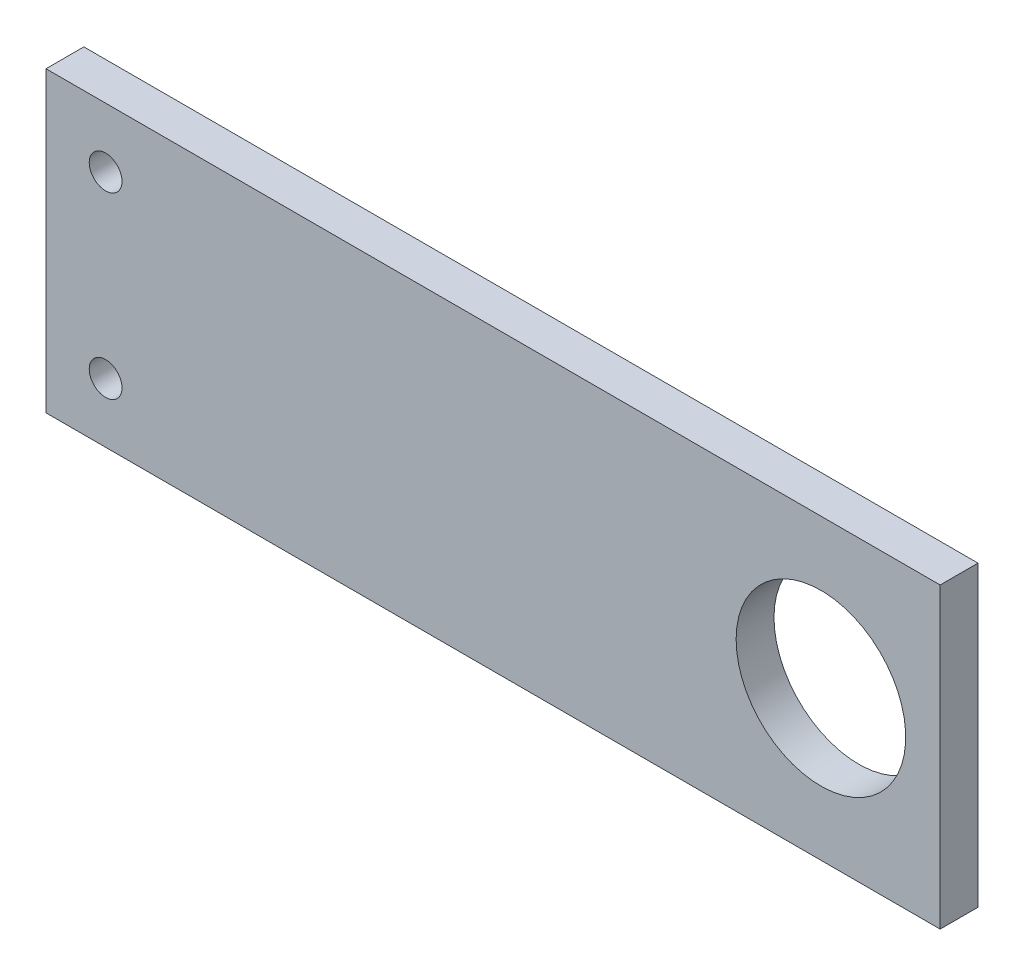
ISO-10303-21;
HEADER;
FILE_DESCRIPTION(('STEP AP214'),'2;1');
FILE_NAME('part.step','',(''),(''),'','','');
FILE_SCHEMA(('AUTOMOTIVE_DESIGN { 1 0 10303 214 1 1 1 1 }'));
ENDSEC;
DATA;
#1=APPLICATION_CONTEXT('core data for automotive mechanical design processes');
#2=APPLICATION_PROTOCOL_DEFINITION('international standard','automotive_design',2000,#1);
#3=PRODUCT_CONTEXT('',#1,'mechanical');
#4=PRODUCT('Part','Part','',(#3));
#5=PRODUCT_RELATED_PRODUCT_CATEGORY('part','',(#4));
#6=PRODUCT_DEFINITION_FORMATION('','',#4);
#7=PRODUCT_DEFINITION_CONTEXT('part definition',#1,'design');
#8=PRODUCT_DEFINITION('design','',#6,#7);
#9=PRODUCT_DEFINITION_SHAPE('','',#8);
#10=(LENGTH_UNIT() NAMED_UNIT(*) SI_UNIT(.MILLI.,.METRE.));
#11=(NAMED_UNIT(*) PLANE_ANGLE_UNIT() SI_UNIT($,.RADIAN.));
#12=(NAMED_UNIT(*) SI_UNIT($,.STERADIAN.) SOLID_ANGLE_UNIT());
#13=UNCERTAINTY_MEASURE_WITH_UNIT(LENGTH_MEASURE(1.E-05),#10,'distance_accuracy_value','');
#14=(GEOMETRIC_REPRESENTATION_CONTEXT(3) GLOBAL_UNCERTAINTY_ASSIGNED_CONTEXT((#13)) GLOBAL_UNIT_ASSIGNED_CONTEXT((#10,
#11,#12)) REPRESENTATION_CONTEXT('',''));
#15=CARTESIAN_POINT('',(0.,0.,0.));
#16=DIRECTION('',(0.,0.,1.));
#17=DIRECTION('',(1.,0.,0.));
#18=AXIS2_PLACEMENT_3D('',#15,#16,#17);
#19=CARTESIAN_POINT('',(0.,0.,6.35));
#20=DIRECTION('',(1.,0.,0.));
#21=DIRECTION('',(0.,0.,-1.));
#22=AXIS2_PLACEMENT_3D('',#19,#20,#21);
#23=PLANE('',#22);
#24=DIRECTION('',(0.,-1.,0.));
#25=VECTOR('',#24,1.);
#26=CARTESIAN_POINT('',(0.,0.,0.));
#27=LINE('',#26,#25);
#28=CARTESIAN_POINT('',(0.,0.,0.));
#29=VERTEX_POINT('',#28);
#30=CARTESIAN_POINT('',(0.,-50.,0.));
#31=VERTEX_POINT('',#30);
#32=EDGE_CURVE('E161',#29,#31,#27,.T.);
#33=ORIENTED_EDGE('',*,*,#32,.T.);
#34=DIRECTION('',(0.,0.,-1.));
#35=VECTOR('',#34,1.);
#36=CARTESIAN_POINT('',(0.,-50.,6.35));
#37=LINE('',#36,#35);
#38=CARTESIAN_POINT('',(0.,-50.,6.35));
#39=VERTEX_POINT('',#38);
#40=EDGE_CURVE('E12',#39,#31,#37,.T.);
#41=ORIENTED_EDGE('',*,*,#40,.F.);
#42=DIRECTION('',(0.,-1.,0.));
#43=VECTOR('',#42,1.);
#44=CARTESIAN_POINT('',(0.,0.,6.35));
#45=LINE('',#44,#43);
#46=CARTESIAN_POINT('',(0.,0.,6.35));
#47=VERTEX_POINT('',#46);
#48=EDGE_CURVE('E149',#47,#39,#45,.T.);
#49=ORIENTED_EDGE('',*,*,#48,.F.);
#50=DIRECTION('',(0.,0.,-1.));
#51=VECTOR('',#50,1.);
#52=CARTESIAN_POINT('',(0.,0.,6.35));
#53=LINE('',#52,#51);
#54=EDGE_CURVE('E160',#47,#29,#53,.T.);
#55=ORIENTED_EDGE('',*,*,#54,.T.);
#56=EDGE_LOOP('',(#33,#41,#49,#55));
#57=FACE_BOUND('',#56,.T.);
#58=ADVANCED_FACE('F98',(#57),#23,.F.);
#59=CARTESIAN_POINT('',(0.,-50.,6.35));
#60=DIRECTION('',(0.,1.,0.));
#61=DIRECTION('',(0.,0.,1.));
#62=AXIS2_PLACEMENT_3D('',#59,#60,#61);
#63=PLANE('',#62);
#64=DIRECTION('',(1.,0.,0.));
#65=VECTOR('',#64,1.);
#66=CARTESIAN_POINT('',(0.,-50.,0.));
#67=LINE('',#66,#65);
#68=CARTESIAN_POINT('',(150.,-50.,0.));
#69=VERTEX_POINT('',#68);
#70=EDGE_CURVE('E153',#31,#69,#67,.T.);
#71=ORIENTED_EDGE('',*,*,#70,.T.);
#72=DIRECTION('',(0.,0.,-1.));
#73=VECTOR('',#72,1.);
#74=CARTESIAN_POINT('',(150.,-50.,6.35));
#75=LINE('',#74,#73);
#76=CARTESIAN_POINT('',(150.,-50.,6.35));
#77=VERTEX_POINT('',#76);
#78=EDGE_CURVE('E106',#77,#69,#75,.T.);
#79=ORIENTED_EDGE('',*,*,#78,.F.);
#80=DIRECTION('',(1.,0.,0.));
#81=VECTOR('',#80,1.);
#82=CARTESIAN_POINT('',(0.,-50.,6.35));
#83=LINE('',#82,#81);
#84=EDGE_CURVE('E145',#39,#77,#83,.T.);
#85=ORIENTED_EDGE('',*,*,#84,.F.);
#86=ORIENTED_EDGE('',*,*,#40,.T.);
#87=EDGE_LOOP('',(#71,#79,#85,#86));
#88=FACE_BOUND('',#87,.T.);
#89=ADVANCED_FACE('F155',(#88),#63,.F.);
#90=CARTESIAN_POINT('',(150.,0.,6.35));
#91=DIRECTION('',(-1.,0.,0.));
#92=DIRECTION('',(0.,-1.,0.));
#93=AXIS2_PLACEMENT_3D('',#90,#91,#92);
#94=PLANE('',#93);
#95=DIRECTION('',(0.,1.,0.));
#96=VECTOR('',#95,1.);
#97=CARTESIAN_POINT('',(150.,0.,0.));
#98=LINE('',#97,#96);
#99=CARTESIAN_POINT('',(150.,0.,0.));
#100=VERTEX_POINT('',#99);
#101=EDGE_CURVE('E134',#69,#100,#98,.T.);
#102=ORIENTED_EDGE('',*,*,#101,.T.);
#103=DIRECTION('',(0.,0.,-1.));
#104=VECTOR('',#103,1.);
#105=CARTESIAN_POINT('',(150.,0.,6.35));
#106=LINE('',#105,#104);
#107=CARTESIAN_POINT('',(150.,0.,6.35));
#108=VERTEX_POINT('',#107);
#109=EDGE_CURVE('E152',#108,#100,#106,.T.);
#110=ORIENTED_EDGE('',*,*,#109,.F.);
#111=DIRECTION('',(0.,1.,0.));
#112=VECTOR('',#111,1.);
#113=CARTESIAN_POINT('',(150.,0.,6.35));
#114=LINE('',#113,#112);
#115=EDGE_CURVE('E150',#77,#108,#114,.T.);
#116=ORIENTED_EDGE('',*,*,#115,.F.);
#117=ORIENTED_EDGE('',*,*,#78,.T.);
#118=EDGE_LOOP('',(#102,#110,#116,#117));
#119=FACE_BOUND('',#118,.T.);
#120=ADVANCED_FACE('F154',(#119),#94,.F.);
#121=CARTESIAN_POINT('',(0.,0.,6.35));
#122=DIRECTION('',(0.,-1.,0.));
#123=DIRECTION('',(0.,0.,-1.));
#124=AXIS2_PLACEMENT_3D('',#121,#122,#123);
#125=PLANE('',#124);
#126=DIRECTION('',(-1.,0.,0.));
#127=VECTOR('',#126,1.);
#128=CARTESIAN_POINT('',(0.,0.,0.));
#129=LINE('',#128,#127);
#130=EDGE_CURVE('E140',#100,#29,#129,.T.);
#131=ORIENTED_EDGE('',*,*,#130,.T.);
#132=ORIENTED_EDGE('',*,*,#54,.F.);
#133=DIRECTION('',(-1.,0.,0.));
#134=VECTOR('',#133,1.);
#135=CARTESIAN_POINT('',(0.,0.,6.35));
#136=LINE('',#135,#134);
#137=EDGE_CURVE('E111',#108,#47,#136,.T.);
#138=ORIENTED_EDGE('',*,*,#137,.F.);
#139=ORIENTED_EDGE('',*,*,#109,.T.);
#140=EDGE_LOOP('',(#131,#132,#138,#139));
#141=FACE_BOUND('',#140,.T.);
#142=ADVANCED_FACE('F166',(#141),#125,.F.);
#143=CARTESIAN_POINT('',(0.,0.,6.35));
#144=DIRECTION('',(0.,0.,1.));
#145=DIRECTION('',(1.,0.,0.));
#146=AXIS2_PLACEMENT_3D('',#143,#144,#145);
#147=PLANE('',#146);
#148=CARTESIAN_POINT('',(10.,-10.,6.35));
#149=DIRECTION('',(0.,0.,-1.));
#150=DIRECTION('',(-1.,0.,0.));
#151=AXIS2_PLACEMENT_3D('',#148,#149,#150);
#152=CIRCLE('',#151,2.75);
#153=CARTESIAN_POINT('',(7.25000000000001,-10.,6.35));
#154=VERTEX_POINT('',#153);
#155=EDGE_CURVE('E178',#154,#154,#152,.T.);
#156=ORIENTED_EDGE('',*,*,#155,.T.);
#157=EDGE_LOOP('',(#156));
#158=FACE_BOUND('',#157,.T.);
#159=CARTESIAN_POINT('',(10.,-40.,6.35));
#160=DIRECTION('',(0.,0.,-1.));
#161=DIRECTION('',(-1.,0.,0.));
#162=AXIS2_PLACEMENT_3D('',#159,#160,#161);
#163=CIRCLE('',#162,2.75);
#164=CARTESIAN_POINT('',(7.25,-40.,6.35));
#165=VERTEX_POINT('',#164);
#166=EDGE_CURVE('E182',#165,#165,#163,.T.);
#167=ORIENTED_EDGE('',*,*,#166,.T.);
#168=EDGE_LOOP('',(#167));
#169=FACE_BOUND('',#168,.T.);
#170=CARTESIAN_POINT('',(130.,-25.,6.35));
#171=DIRECTION('',(0.,0.,-1.));
#172=DIRECTION('',(-1.,0.,0.));
#173=AXIS2_PLACEMENT_3D('',#170,#171,#172);
#174=CIRCLE('',#173,14.225);
#175=CARTESIAN_POINT('',(115.775,-25.,6.35));
#176=VERTEX_POINT('',#175);
#177=EDGE_CURVE('E163',#176,#176,#174,.T.);
#178=ORIENTED_EDGE('',*,*,#177,.T.);
#179=EDGE_LOOP('',(#178));
#180=FACE_BOUND('',#179,.T.);
#181=ORIENTED_EDGE('',*,*,#48,.T.);
#182=ORIENTED_EDGE('',*,*,#84,.T.);
#183=ORIENTED_EDGE('',*,*,#115,.T.);
#184=ORIENTED_EDGE('',*,*,#137,.T.);
#185=EDGE_LOOP('',(#181,#182,#183,#184));
#186=FACE_BOUND('',#185,.T.);
#187=ADVANCED_FACE('F144',(#158,#169,#180,#186),#147,.T.);
#188=CARTESIAN_POINT('',(0.,0.,0.));
#189=DIRECTION('',(0.,0.,1.));
#190=DIRECTION('',(1.,0.,0.));
#191=AXIS2_PLACEMENT_3D('',#188,#189,#190);
#192=PLANE('',#191);
#193=CARTESIAN_POINT('',(10.,-10.,0.));
#194=DIRECTION('',(0.,0.,-1.));
#195=DIRECTION('',(-1.,0.,0.));
#196=AXIS2_PLACEMENT_3D('',#193,#194,#195);
#197=CIRCLE('',#196,2.75);
#198=CARTESIAN_POINT('',(7.25000000000001,-10.,0.));
#199=VERTEX_POINT('',#198);
#200=EDGE_CURVE('E186',#199,#199,#197,.T.);
#201=ORIENTED_EDGE('',*,*,#200,.F.);
#202=EDGE_LOOP('',(#201));
#203=FACE_BOUND('',#202,.T.);
#204=CARTESIAN_POINT('',(10.,-40.,0.));
#205=DIRECTION('',(0.,0.,-1.));
#206=DIRECTION('',(-1.,0.,0.));
#207=AXIS2_PLACEMENT_3D('',#204,#205,#206);
#208=CIRCLE('',#207,2.75);
#209=CARTESIAN_POINT('',(7.25,-40.,0.));
#210=VERTEX_POINT('',#209);
#211=EDGE_CURVE('E184',#210,#210,#208,.T.);
#212=ORIENTED_EDGE('',*,*,#211,.F.);
#213=EDGE_LOOP('',(#212));
#214=FACE_BOUND('',#213,.T.);
#215=CARTESIAN_POINT('',(130.,-25.,0.));
#216=DIRECTION('',(0.,0.,-1.));
#217=DIRECTION('',(-1.,0.,0.));
#218=AXIS2_PLACEMENT_3D('',#215,#216,#217);
#219=CIRCLE('',#218,14.225);
#220=CARTESIAN_POINT('',(115.775,-25.,0.));
#221=VERTEX_POINT('',#220);
#222=EDGE_CURVE('E172',#221,#221,#219,.T.);
#223=ORIENTED_EDGE('',*,*,#222,.F.);
#224=EDGE_LOOP('',(#223));
#225=FACE_BOUND('',#224,.T.);
#226=ORIENTED_EDGE('',*,*,#32,.F.);
#227=ORIENTED_EDGE('',*,*,#130,.F.);
#228=ORIENTED_EDGE('',*,*,#101,.F.);
#229=ORIENTED_EDGE('',*,*,#70,.F.);
#230=EDGE_LOOP('',(#226,#227,#228,#229));
#231=FACE_BOUND('',#230,.T.);
#232=ADVANCED_FACE('F171',(#203,#214,#225,#231),#192,.F.);
#233=CARTESIAN_POINT('',(130.,-25.,6.35));
#234=DIRECTION('',(0.,0.,-1.));
#235=DIRECTION('',(-1.,0.,0.));
#236=AXIS2_PLACEMENT_3D('',#233,#234,#235);
#237=CYLINDRICAL_SURFACE('',#236,14.225);
#238=ORIENTED_EDGE('',*,*,#177,.F.);
#239=EDGE_LOOP('',(#238));
#240=FACE_BOUND('',#239,.T.);
#241=ORIENTED_EDGE('',*,*,#222,.T.);
#242=EDGE_LOOP('',(#241));
#243=FACE_BOUND('',#242,.T.);
#244=ADVANCED_FACE('F204',(#240,#243),#237,.F.);
#245=CARTESIAN_POINT('',(10.,-40.,6.35));
#246=DIRECTION('',(0.,0.,-1.));
#247=DIRECTION('',(-1.,0.,0.));
#248=AXIS2_PLACEMENT_3D('',#245,#246,#247);
#249=CYLINDRICAL_SURFACE('',#248,2.75);
#250=ORIENTED_EDGE('',*,*,#166,.F.);
#251=EDGE_LOOP('',(#250));
#252=FACE_BOUND('',#251,.T.);
#253=ORIENTED_EDGE('',*,*,#211,.T.);
#254=EDGE_LOOP('',(#253));
#255=FACE_BOUND('',#254,.T.);
#256=ADVANCED_FACE('F196',(#252,#255),#249,.F.);
#257=CARTESIAN_POINT('',(10.,-10.,6.35));
#258=DIRECTION('',(0.,0.,-1.));
#259=DIRECTION('',(-1.,0.,0.));
#260=AXIS2_PLACEMENT_3D('',#257,#258,#259);
#261=CYLINDRICAL_SURFACE('',#260,2.75);
#262=ORIENTED_EDGE('',*,*,#155,.F.);
#263=EDGE_LOOP('',(#262));
#264=FACE_BOUND('',#263,.T.);
#265=ORIENTED_EDGE('',*,*,#200,.T.);
#266=EDGE_LOOP('',(#265));
#267=FACE_BOUND('',#266,.T.);
#268=ADVANCED_FACE('F194',(#264,#267),#261,.F.);
#269=CLOSED_SHELL('',(#58,#89,#120,#142,#187,#232,#244,#256,#268));
#270=MANIFOLD_SOLID_BREP('B2',#269);
#271=ADVANCED_BREP_SHAPE_REPRESENTATION('',(#18,#270),#14);
#272=SHAPE_DEFINITION_REPRESENTATION(#9,#271);
ENDSEC;
END-ISO-10303-21;
